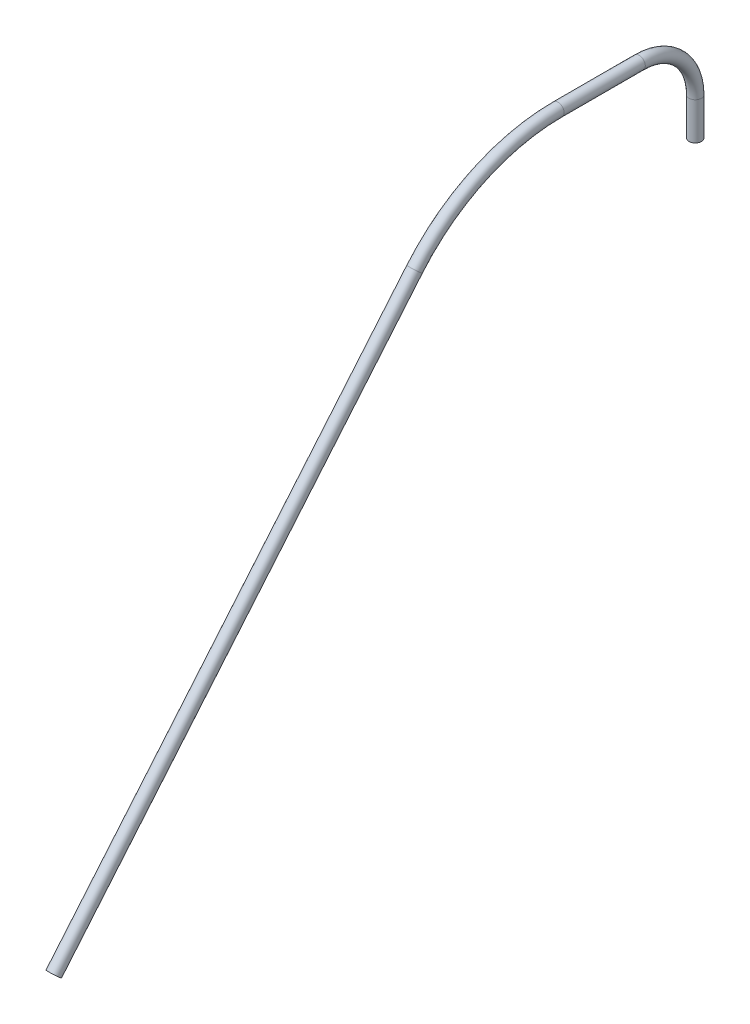
ISO-10303-21;
HEADER;
FILE_DESCRIPTION(('STEP AP214'),'2;1');
FILE_NAME('part.step','',(''),(''),'','','');
FILE_SCHEMA(('AUTOMOTIVE_DESIGN { 1 0 10303 214 1 1 1 1 }'));
ENDSEC;
DATA;
#1=APPLICATION_CONTEXT('core data for automotive mechanical design processes');
#2=APPLICATION_PROTOCOL_DEFINITION('international standard','automotive_design',2000,#1);
#3=PRODUCT_CONTEXT('',#1,'mechanical');
#4=PRODUCT('Part','Part','',(#3));
#5=PRODUCT_RELATED_PRODUCT_CATEGORY('part','',(#4));
#6=PRODUCT_DEFINITION_FORMATION('','',#4);
#7=PRODUCT_DEFINITION_CONTEXT('part definition',#1,'design');
#8=PRODUCT_DEFINITION('design','',#6,#7);
#9=PRODUCT_DEFINITION_SHAPE('','',#8);
#10=(LENGTH_UNIT() NAMED_UNIT(*) SI_UNIT(.MILLI.,.METRE.));
#11=(NAMED_UNIT(*) PLANE_ANGLE_UNIT() SI_UNIT($,.RADIAN.));
#12=(NAMED_UNIT(*) SI_UNIT($,.STERADIAN.) SOLID_ANGLE_UNIT());
#13=UNCERTAINTY_MEASURE_WITH_UNIT(LENGTH_MEASURE(1.E-05),#10,'distance_accuracy_value','');
#14=(GEOMETRIC_REPRESENTATION_CONTEXT(3) GLOBAL_UNCERTAINTY_ASSIGNED_CONTEXT((#13)) GLOBAL_UNIT_ASSIGNED_CONTEXT((#10,
#11,#12)) REPRESENTATION_CONTEXT('',''));
#15=CARTESIAN_POINT('',(0.,0.,0.));
#16=DIRECTION('',(0.,0.,1.));
#17=DIRECTION('',(1.,0.,0.));
#18=AXIS2_PLACEMENT_3D('',#15,#16,#17);
#19=CARTESIAN_POINT('',(0.,0.,0.));
#20=DIRECTION('',(0.,1.,0.));
#21=DIRECTION('',(0.,0.,1.));
#22=AXIS2_PLACEMENT_3D('',#19,#20,#21);
#23=PLANE('',#22);
#24=CARTESIAN_POINT('',(0.,0.,0.));
#25=DIRECTION('',(0.,1.,0.));
#26=DIRECTION('',(0.,0.,1.));
#27=AXIS2_PLACEMENT_3D('',#24,#25,#26);
#28=CIRCLE('',#27,3.3);
#29=CARTESIAN_POINT('',(0.,0.,3.3));
#30=VERTEX_POINT('',#29);
#31=EDGE_CURVE('E66',#30,#30,#28,.T.);
#32=ORIENTED_EDGE('',*,*,#31,.F.);
#33=EDGE_LOOP('',(#32));
#34=FACE_BOUND('',#33,.T.);
#35=ADVANCED_FACE('F39',(#34),#23,.F.);
#36=CARTESIAN_POINT('',(0.,-215.534571967038,342.836282905963));
#37=DIRECTION('',(0.,-0.766044443118976,0.642787609686541));
#38=DIRECTION('',(0.,-0.642787609686541,-0.766044443118976));
#39=AXIS2_PLACEMENT_3D('',#36,#37,#38);
#40=PLANE('',#39);
#41=CARTESIAN_POINT('',(0.,-215.534571967038,342.836282905963));
#42=DIRECTION('',(0.,-0.766044443118976,0.642787609686541));
#43=DIRECTION('',(0.,-0.642787609686541,-0.766044443118976));
#44=AXIS2_PLACEMENT_3D('',#41,#42,#43);
#45=CIRCLE('',#44,3.3);
#46=CARTESIAN_POINT('',(0.,-217.655771079004,340.30833624367));
#47=VERTEX_POINT('',#46);
#48=EDGE_CURVE('E10',#47,#47,#45,.T.);
#49=ORIENTED_EDGE('',*,*,#48,.T.);
#50=EDGE_LOOP('',(#49));
#51=FACE_BOUND('',#50,.T.);
#52=ADVANCED_FACE('F74',(#51),#40,.T.);
#53=CARTESIAN_POINT('',(0.,0.,0.));
#54=DIRECTION('',(0.,1.,0.));
#55=DIRECTION('',(0.,0.,1.));
#56=AXIS2_PLACEMENT_3D('',#53,#54,#55);
#57=CYLINDRICAL_SURFACE('',#56,3.3);
#58=CARTESIAN_POINT('',(0.,19.9999999999999,0.));
#59=DIRECTION('',(0.,1.,0.));
#60=DIRECTION('',(0.,0.,1.));
#61=AXIS2_PLACEMENT_3D('',#58,#59,#60);
#62=CIRCLE('',#61,3.3);
#63=CARTESIAN_POINT('',(0.,19.9999999999999,-3.30000000000006));
#64=VERTEX_POINT('',#63);
#65=EDGE_CURVE('E62',#64,#64,#62,.T.);
#66=ORIENTED_EDGE('',*,*,#65,.F.);
#67=EDGE_LOOP('',(#66));
#68=FACE_BOUND('',#67,.T.);
#69=ORIENTED_EDGE('',*,*,#31,.T.);
#70=EDGE_LOOP('',(#69));
#71=FACE_BOUND('',#70,.T.);
#72=ADVANCED_FACE('F71',(#68,#71),#57,.T.);
#73=CARTESIAN_POINT('',(0.,19.9999999999999,29.9999999999999));
#74=DIRECTION('',(1.,0.,0.));
#75=DIRECTION('',(0.,0.,-1.));
#76=AXIS2_PLACEMENT_3D('',#73,#74,#75);
#77=TOROIDAL_SURFACE('',#76,30.,3.3);
#78=CARTESIAN_POINT('',(0.,49.9999999999999,29.9999999999999));
#79=DIRECTION('',(0.,0.,1.));
#80=DIRECTION('',(0.,-1.,0.));
#81=AXIS2_PLACEMENT_3D('',#78,#79,#80);
#82=CIRCLE('',#81,3.3);
#83=CARTESIAN_POINT('',(0.,53.2999999999999,29.9999999999999));
#84=VERTEX_POINT('',#83);
#85=EDGE_CURVE('E56',#84,#84,#82,.T.);
#86=CARTESIAN_POINT('',(0.,19.9999999999999,29.9999999999999));
#87=DIRECTION('',(1.,0.,0.));
#88=DIRECTION('',(0.,0.,-1.));
#89=AXIS2_PLACEMENT_3D('',#86,#87,#88);
#90=CIRCLE('',#89,33.3);
#91=EDGE_CURVE('',#64,#84,#90,.T.);
#92=ORIENTED_EDGE('',*,*,#65,.T.);
#93=ORIENTED_EDGE('',*,*,#85,.F.);
#94=ORIENTED_EDGE('',*,*,#91,.T.);
#95=ORIENTED_EDGE('',*,*,#91,.F.);
#96=EDGE_LOOP('',(#92,#94,#93,#95));
#97=FACE_BOUND('',#96,.T.);
#98=ADVANCED_FACE('F92',(#97),#77,.T.);
#99=CARTESIAN_POINT('',(0.,49.9999999999999,29.9999999999999));
#100=DIRECTION('',(0.,0.,1.));
#101=DIRECTION('',(0.,-1.,0.));
#102=AXIS2_PLACEMENT_3D('',#99,#100,#101);
#103=CYLINDRICAL_SURFACE('',#102,3.3);
#104=CARTESIAN_POINT('',(0.,50.,73.3955556881024));
#105=DIRECTION('',(0.,0.,1.));
#106=DIRECTION('',(0.,-1.,0.));
#107=AXIS2_PLACEMENT_3D('',#104,#105,#106);
#108=CIRCLE('',#107,3.3);
#109=CARTESIAN_POINT('',(0.,53.3,73.3955556881024));
#110=VERTEX_POINT('',#109);
#111=EDGE_CURVE('E51',#110,#110,#108,.T.);
#112=ORIENTED_EDGE('',*,*,#111,.F.);
#113=EDGE_LOOP('',(#112));
#114=FACE_BOUND('',#113,.T.);
#115=ORIENTED_EDGE('',*,*,#85,.T.);
#116=EDGE_LOOP('',(#115));
#117=FACE_BOUND('',#116,.T.);
#118=ADVANCED_FACE('F86',(#114,#117),#103,.T.);
#119=CARTESIAN_POINT('',(0.,-50.,73.3955556881025));
#120=DIRECTION('',(1.,0.,0.));
#121=DIRECTION('',(0.,0.,-1.));
#122=AXIS2_PLACEMENT_3D('',#119,#120,#121);
#123=TOROIDAL_SURFACE('',#122,100.,3.3);
#124=CARTESIAN_POINT('',(0.,14.2787609686544,150.));
#125=DIRECTION('',(0.,-0.766044443118976,0.642787609686541));
#126=DIRECTION('',(0.,-0.642787609686541,-0.766044443118976));
#127=AXIS2_PLACEMENT_3D('',#124,#125,#126);
#128=CIRCLE('',#127,3.3);
#129=CARTESIAN_POINT('',(0.,16.39996008062,152.527946662293));
#130=VERTEX_POINT('',#129);
#131=EDGE_CURVE('E46',#130,#130,#128,.T.);
#132=CARTESIAN_POINT('',(0.,-50.,73.3955556881025));
#133=DIRECTION('',(1.,0.,0.));
#134=DIRECTION('',(0.,0.,-1.));
#135=AXIS2_PLACEMENT_3D('',#132,#133,#134);
#136=CIRCLE('',#135,103.3);
#137=EDGE_CURVE('',#110,#130,#136,.T.);
#138=ORIENTED_EDGE('',*,*,#111,.T.);
#139=ORIENTED_EDGE('',*,*,#131,.F.);
#140=ORIENTED_EDGE('',*,*,#137,.T.);
#141=ORIENTED_EDGE('',*,*,#137,.F.);
#142=EDGE_LOOP('',(#138,#140,#139,#141));
#143=FACE_BOUND('',#142,.T.);
#144=ADVANCED_FACE('F80',(#143),#123,.T.);
#145=CARTESIAN_POINT('',(0.,14.2787609686544,150.));
#146=DIRECTION('',(0.,-0.766044443118975,0.642787609686543));
#147=DIRECTION('',(0.,-0.642787609686543,-0.766044443118975));
#148=AXIS2_PLACEMENT_3D('',#145,#146,#147);
#149=CYLINDRICAL_SURFACE('',#148,3.3);
#150=ORIENTED_EDGE('',*,*,#48,.F.);
#151=EDGE_LOOP('',(#150));
#152=FACE_BOUND('',#151,.T.);
#153=ORIENTED_EDGE('',*,*,#131,.T.);
#154=EDGE_LOOP('',(#153));
#155=FACE_BOUND('',#154,.T.);
#156=ADVANCED_FACE('F78',(#152,#155),#149,.T.);
#157=CLOSED_SHELL('',(#35,#52,#72,#98,#118,#144,#156));
#158=MANIFOLD_SOLID_BREP('B2',#157);
#159=ADVANCED_BREP_SHAPE_REPRESENTATION('',(#18,#158),#14);
#160=SHAPE_DEFINITION_REPRESENTATION(#9,#159);
ENDSEC;
END-ISO-10303-21;
